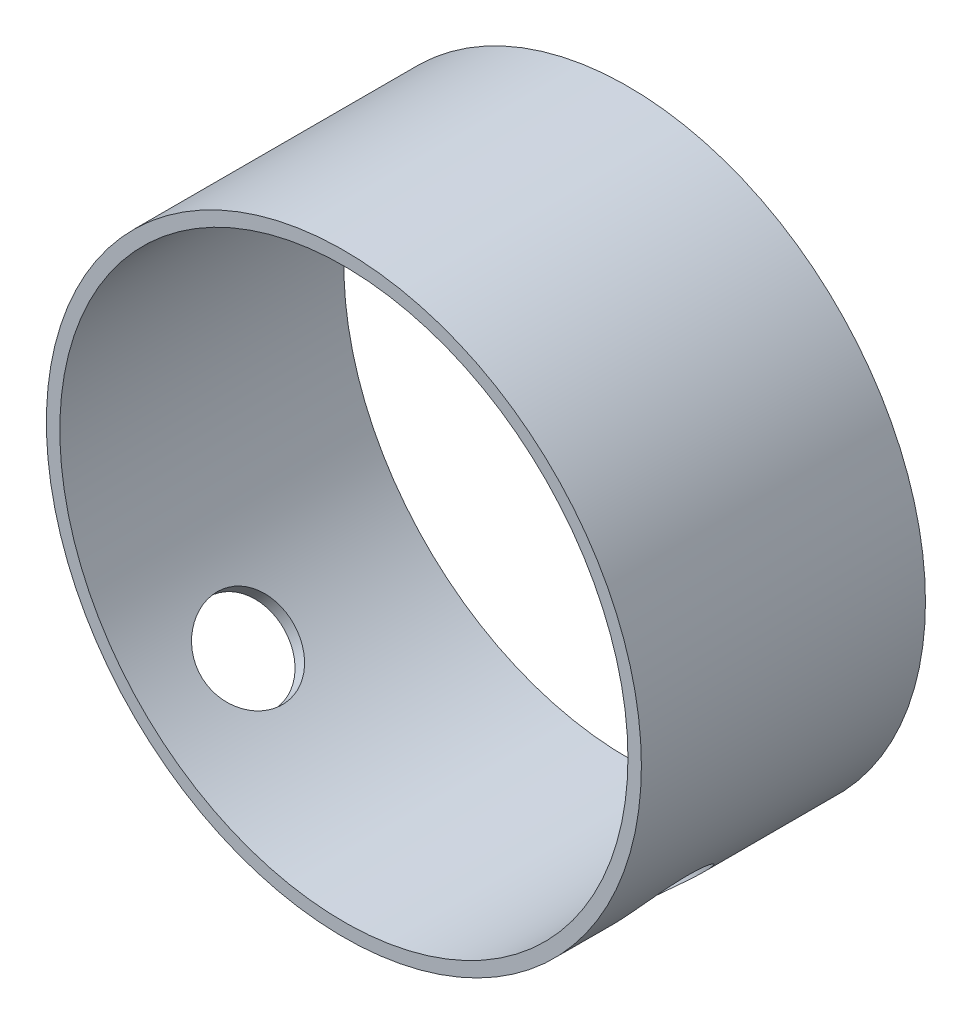
ISO-10303-21;
HEADER;
FILE_DESCRIPTION(('STEP AP214'),'2;1');
FILE_NAME('part.step','',(''),(''),'','','');
FILE_SCHEMA(('AUTOMOTIVE_DESIGN { 1 0 10303 214 1 1 1 1 }'));
ENDSEC;
DATA;
#1=APPLICATION_CONTEXT('core data for automotive mechanical design processes');
#2=APPLICATION_PROTOCOL_DEFINITION('international standard','automotive_design',2000,#1);
#3=PRODUCT_CONTEXT('',#1,'mechanical');
#4=PRODUCT('Part','Part','',(#3));
#5=PRODUCT_RELATED_PRODUCT_CATEGORY('part','',(#4));
#6=PRODUCT_DEFINITION_FORMATION('','',#4);
#7=PRODUCT_DEFINITION_CONTEXT('part definition',#1,'design');
#8=PRODUCT_DEFINITION('design','',#6,#7);
#9=PRODUCT_DEFINITION_SHAPE('','',#8);
#10=(LENGTH_UNIT() NAMED_UNIT(*) SI_UNIT(.MILLI.,.METRE.));
#11=(NAMED_UNIT(*) PLANE_ANGLE_UNIT() SI_UNIT($,.RADIAN.));
#12=(NAMED_UNIT(*) SI_UNIT($,.STERADIAN.) SOLID_ANGLE_UNIT());
#13=UNCERTAINTY_MEASURE_WITH_UNIT(LENGTH_MEASURE(1.E-05),#10,'distance_accuracy_value','');
#14=(GEOMETRIC_REPRESENTATION_CONTEXT(3) GLOBAL_UNCERTAINTY_ASSIGNED_CONTEXT((#13)) GLOBAL_UNIT_ASSIGNED_CONTEXT((#10,
#11,#12)) REPRESENTATION_CONTEXT('',''));
#15=CARTESIAN_POINT('',(0.,0.,0.));
#16=DIRECTION('',(0.,0.,1.));
#17=DIRECTION('',(1.,0.,0.));
#18=AXIS2_PLACEMENT_3D('',#15,#16,#17);
#19=CARTESIAN_POINT('',(0.,0.,19.05));
#20=DIRECTION('',(0.,0.,-1.));
#21=DIRECTION('',(-1.,0.,0.));
#22=AXIS2_PLACEMENT_3D('',#19,#20,#21);
#23=CYLINDRICAL_SURFACE('',#22,39.9034);
#24=CARTESIAN_POINT('',(23.501589202211,-32.2483586641323,5.08));
#25=CARTESIAN_POINT('',(23.5015867388899,-32.2483596567313,5.25264083242992));
#26=CARTESIAN_POINT('',(23.5075056643356,-32.2440492099816,5.42524780021009));
#27=CARTESIAN_POINT('',(23.5311150998789,-32.2268239254793,5.76927656795172));
#28=CARTESIAN_POINT('',(23.5488080465942,-32.2139073066904,5.94069811517103));
#29=CARTESIAN_POINT('',(23.5957998250419,-32.1795028752748,6.28118488099849));
#30=CARTESIAN_POINT('',(23.6251064033576,-32.1580093415639,6.45024844869669));
#31=CARTESIAN_POINT('',(23.6950313731235,-32.1065212103511,6.78476842586552));
#32=CARTESIAN_POINT('',(23.7356539152229,-32.076523493478,6.95022348769339));
#33=CARTESIAN_POINT('',(23.8277355392797,-32.0081806866277,7.27610556281692));
#34=CARTESIAN_POINT('',(23.8791819337938,-31.9698453680143,7.43653821251666));
#35=CARTESIAN_POINT('',(23.9924446547623,-31.8849327931174,7.7515215472872));
#36=CARTESIAN_POINT('',(24.0542648023972,-31.8383524994427,7.90607003909233));
#37=CARTESIAN_POINT('',(24.1876222577679,-31.7371589742097,8.20808256396437));
#38=CARTESIAN_POINT('',(24.2591545882514,-31.6825498560443,8.35555017374673));
#39=CARTESIAN_POINT('',(24.4113067022659,-31.5654661129088,8.64253448812991));
#40=CARTESIAN_POINT('',(24.4919298598801,-31.5029885665392,8.78204821150893));
#41=CARTESIAN_POINT('',(24.6621102215491,-31.3699441665952,9.05310297986707));
#42=CARTESIAN_POINT('',(24.7517281497411,-31.2993217736931,9.18457864494051));
#43=CARTESIAN_POINT('',(24.9386127042829,-31.1506209969095,9.43758606094543));
#44=CARTESIAN_POINT('',(25.0358821493897,-31.072539862996,9.55911411329576));
#45=CARTESIAN_POINT('',(25.2371358015658,-30.9093041917313,9.79129652382624));
#46=CARTESIAN_POINT('',(25.3411179126482,-30.8241518599611,9.90195424924258));
#47=CARTESIAN_POINT('',(25.5549494829816,-30.6471068704479,10.1117057895883));
#48=CARTESIAN_POINT('',(25.6648010915063,-30.5552117389863,10.2107953256242));
#49=CARTESIAN_POINT('',(25.8899284242549,-30.3646962650921,10.3971072700783));
#50=CARTESIAN_POINT('',(26.0052275891763,-30.266045844583,10.4842706211443));
#51=CARTESIAN_POINT('',(26.2398141953946,-30.0628936055371,10.6455630747084));
#52=CARTESIAN_POINT('',(26.3591031049072,-29.9583896231436,10.7196873146172));
#53=CARTESIAN_POINT('',(26.6005877649385,-29.7441770659692,10.8542850395984));
#54=CARTESIAN_POINT('',(26.7227822904992,-29.6344706657028,10.9147641682632));
#55=CARTESIAN_POINT('',(26.9691204180119,-29.4104690823445,11.0216720204418));
#56=CARTESIAN_POINT('',(27.0932647157193,-29.2961722374552,11.0680956027885));
#57=CARTESIAN_POINT('',(27.4650260998787,-28.9493912247405,11.1850089226742));
#58=CARTESIAN_POINT('',(27.7141992872647,-28.7110476182863,11.2343760436793));
#59=CARTESIAN_POINT('',(28.2084410009719,-28.2256156963798,11.2746251576714));
#60=CARTESIAN_POINT('',(28.4535097693208,-27.9785278992452,11.2655106114424));
#61=CARTESIAN_POINT('',(28.9306573414012,-27.4848176601488,11.1894958646732));
#62=CARTESIAN_POINT('',(29.1628294716007,-27.2382093780848,11.1230915666442));
#63=CARTESIAN_POINT('',(29.6104513458667,-26.7509264569231,10.9351406732932));
#64=CARTESIAN_POINT('',(29.8259006359154,-26.5102519790466,10.8135925814543));
#65=CARTESIAN_POINT('',(30.2359965850196,-26.0415684535962,10.5183064172627));
#66=CARTESIAN_POINT('',(30.430556268792,-25.8136141242541,10.3443608078229));
#67=CARTESIAN_POINT('',(30.793959619304,-25.379002341072,9.94936748084762));
#68=CARTESIAN_POINT('',(30.9628014791169,-25.1723463839789,9.72831645631493));
#69=CARTESIAN_POINT('',(31.2733821460273,-24.7854636501134,9.24262763989351));
#70=CARTESIAN_POINT('',(31.4148178052695,-24.6055371143484,8.97755662010405));
#71=CARTESIAN_POINT('',(31.6660285862854,-24.281395136065,8.41282045975597));
#72=CARTESIAN_POINT('',(31.7758034871949,-24.1371799426687,8.11315507788872));
#73=CARTESIAN_POINT('',(31.962083771596,-23.8899691946169,7.48727743703968));
#74=CARTESIAN_POINT('',(32.0385600869982,-23.7870096604244,7.1610422775753));
#75=CARTESIAN_POINT('',(32.1569443235447,-23.6267282215711,6.49153673138903));
#76=CARTESIAN_POINT('',(32.1988548549292,-23.5694028708498,6.14826763306334));
#77=CARTESIAN_POINT('',(32.2472344991652,-23.5031676226052,5.45824063303899));
#78=CARTESIAN_POINT('',(32.2540657066028,-23.4937630863569,5.11155554044715));
#79=CARTESIAN_POINT('',(32.2331638926317,-23.5224314124339,4.42121380023893));
#80=CARTESIAN_POINT('',(32.2054320190917,-23.5605026980477,4.0775570524304));
#81=CARTESIAN_POINT('',(32.1160584125507,-23.6821813482704,3.40491767910432));
#82=CARTESIAN_POINT('',(32.0545999935968,-23.7655425243161,3.07586602926));
#83=CARTESIAN_POINT('',(31.898792598848,-23.9742616467967,2.43959661019747));
#84=CARTESIAN_POINT('',(31.8044418981428,-24.0996217956942,2.13237998705142));
#85=CARTESIAN_POINT('',(31.5833531649848,-24.3886526984383,1.54579133230891));
#86=CARTESIAN_POINT('',(31.4563614038813,-24.5526226999963,1.26666242869012));
#87=CARTESIAN_POINT('',(31.1723510291138,-24.9122103157281,0.746676206979608));
#88=CARTESIAN_POINT('',(31.0153305985458,-25.1078298447666,0.505821206290403));
#89=CARTESIAN_POINT('',(30.6724148441704,-25.5256313432228,0.0670331661247737));
#90=CARTESIAN_POINT('',(30.4862743496482,-25.7480347735486,-0.130497663992802));
#91=CARTESIAN_POINT('',(30.0897845883679,-26.2102793814115,-0.474222001162207));
#92=CARTESIAN_POINT('',(29.8794360201958,-26.4501200556787,-0.620416989148132));
#93=CARTESIAN_POINT('',(29.4401299630825,-26.9382159302453,-0.856687835609248));
#94=CARTESIAN_POINT('',(29.211248438385,-27.1864345693733,-0.946980850998428));
#95=CARTESIAN_POINT('',(28.7397428844998,-27.6843949395101,-1.06956437613328));
#96=CARTESIAN_POINT('',(28.4971198284347,-27.9341365615522,-1.10185898781945));
#97=CARTESIAN_POINT('',(28.129604500408,-28.3025919386892,-1.10610328845747));
#98=CARTESIAN_POINT('',(28.0070951071386,-28.4238206041768,-1.10028294242092));
#99=CARTESIAN_POINT('',(27.7613135812936,-28.6639181728784,-1.07428782999871));
#100=CARTESIAN_POINT('',(27.6380417515924,-28.7827879429446,-1.05411844094159));
#101=CARTESIAN_POINT('',(27.3916092571537,-29.0174096010688,-0.999561921835617));
#102=CARTESIAN_POINT('',(27.2684486480078,-29.1331603577625,-0.965169704740712));
#103=CARTESIAN_POINT('',(27.0232652523705,-29.360729306101,-0.882445024006713));
#104=CARTESIAN_POINT('',(26.9012420711332,-29.4725489024725,-0.834117597842497));
#105=CARTESIAN_POINT('',(26.6593107747604,-29.6915661089358,-0.723902609240605));
#106=CARTESIAN_POINT('',(26.5394016629286,-29.7987659334664,-0.662021632057408));
#107=CARTESIAN_POINT('',(26.302641509204,-30.0079544216608,-0.525162508171096));
#108=CARTESIAN_POINT('',(26.1857893841401,-30.1099449436597,-0.45018907476797));
#109=CARTESIAN_POINT('',(25.9560078762769,-30.3082502027024,-0.287635068674875));
#110=CARTESIAN_POINT('',(25.8430800169274,-30.4045627453688,-0.200049666254614));
#111=CARTESIAN_POINT('',(25.6221720104697,-30.5909547948338,-0.012942750161353));
#112=CARTESIAN_POINT('',(25.5141901291512,-30.6810364920957,0.0865745348629405));
#113=CARTESIAN_POINT('',(25.3029568605494,-30.8554803099064,0.297970969642424));
#114=CARTESIAN_POINT('',(25.1997659294397,-30.9397736611605,0.409967298047581));
#115=CARTESIAN_POINT('',(25.0002678213334,-31.1011961705694,0.64464592230986));
#116=CARTESIAN_POINT('',(24.903958187665,-31.1783278884533,0.767324369520395));
#117=CARTESIAN_POINT('',(24.7189920782562,-31.325177078556,1.02263337571436));
#118=CARTESIAN_POINT('',(24.6303402341005,-31.3948900696108,1.15526986813435));
#119=CARTESIAN_POINT('',(24.4616037479121,-31.5265400024045,1.42946714718439));
#120=CARTESIAN_POINT('',(24.3815159566361,-31.5884798040284,1.57102462267235));
#121=CARTESIAN_POINT('',(24.230142475845,-31.7047425117433,1.86307066236796));
#122=CARTESIAN_POINT('',(24.1589165958555,-31.7590139651979,2.01361072902575));
#123=CARTESIAN_POINT('',(24.0265966732744,-31.8592352816353,2.32167621673551));
#124=CARTESIAN_POINT('',(23.9654989059264,-31.9051882044498,2.47919904264645));
#125=CARTESIAN_POINT('',(23.8540594658356,-31.9885921138453,2.80005854757225));
#126=CARTESIAN_POINT('',(23.8037100183054,-32.0260492470817,2.96339092379892));
#127=CARTESIAN_POINT('',(23.7142424315332,-32.0923531130944,3.29475266892636));
#128=CARTESIAN_POINT('',(23.6751218043471,-32.1212017532909,3.46278098828972));
#129=CARTESIAN_POINT('',(23.5954091342363,-32.1798288134672,3.86920112208735));
#130=CARTESIAN_POINT('',(23.5602835755989,-32.2055150555432,4.10928848478571));
#131=CARTESIAN_POINT('',(23.5133755143432,-32.2397791580513,4.5929397205141));
#132=CARTESIAN_POINT('',(23.5015926765338,-32.2483572641487,4.83650354357311));
#133=CARTESIAN_POINT('',(23.501589202211,-32.2483586641323,5.08));
#134=B_SPLINE_CURVE_WITH_KNOTS('',3,(#24,#25,#26,#27,#28,#29,#30,#31,#32,#33,#34,#35,#36,#37,
#38,#39,#40,#41,#42,#43,#44,#45,#46,#47,#48,#49,#50,#51,#52,#53,#54,#55,#56,#57,#58,#59,#60,#61,
#62,#63,#64,#65,#66,#67,#68,#69,#70,#71,#72,#73,#74,#75,#76,#77,#78,#79,#80,#81,#82,#83,#84,#85,
#86,#87,#88,#89,#90,#91,#92,#93,#94,#95,#96,#97,#98,#99,#100,#101,#102,#103,#104,#105,#106,#107,
#108,#109,#110,#111,#112,#113,#114,#115,#116,#117,#118,#119,#120,#121,#122,#123,#124,#125,#126,
#127,#128,#129,#130,#131,#132,#133),.UNSPECIFIED.,.T.,.F.,(4,2,2,2,2,2,2,2,2,2,2,2,2,2,2,2,2,2,
2,2,2,2,2,2,2,2,2,2,2,2,2,2,2,2,2,2,2,2,2,2,2,2,2,2,2,2,2,2,2,2,2,2,2,2,4),(0.,
0.517709092500926,1.03552535752683,1.55368760193161,2.07204015695425,2.58978846420537,
3.10772790480225,3.62540290918593,4.14327068634191,4.66490568335334,5.18673375460928,
5.70839966918645,6.2302579326,6.75461346576402,7.27916413071403,7.80349744314928,
8.32802231252932,9.36753841383145,10.4069929999991,11.4375392803052,12.4681135297113,
13.5028246029995,14.5376083412806,15.583255653984,16.6289102609098,17.6754758536253,
18.7219624075493,19.7576249245075,20.7932530471644,21.8233071799754,22.8534153381786,
23.8917866629276,24.9302208348914,25.9779218311203,27.025592600834,28.0691676227002,
29.1126688347547,29.6295137255133,30.1461650297188,30.6630012834423,31.1796509384106,
31.6960501238297,32.2122637867332,32.7286756610432,33.2449050574206,33.7664721113912,
34.2878520220964,34.8095450975504,35.3310456672412,35.8558942229437,36.3805493278896,
36.9048236283615,37.4289816767514,38.1591805405967,38.8893689190334),.UNSPECIFIED.);
#135=CARTESIAN_POINT('',(23.501589202211,-32.2483586641323,5.08));
#136=VERTEX_POINT('',#135);
#137=EDGE_CURVE('E72',#136,#136,#134,.T.);
#138=ORIENTED_EDGE('',*,*,#137,.T.);
#139=EDGE_LOOP('',(#138));
#140=FACE_BOUND('',#139,.T.);
#141=CARTESIAN_POINT('',(0.,0.,19.05));
#142=DIRECTION('',(0.,0.,1.));
#143=DIRECTION('',(1.,0.,0.));
#144=AXIS2_PLACEMENT_3D('',#141,#142,#143);
#145=CIRCLE('',#144,39.9034);
#146=CARTESIAN_POINT('',(39.9034,0.,19.05));
#147=VERTEX_POINT('',#146);
#148=EDGE_CURVE('E10',#147,#147,#145,.T.);
#149=ORIENTED_EDGE('',*,*,#148,.F.);
#150=EDGE_LOOP('',(#149));
#151=FACE_BOUND('',#150,.T.);
#152=CARTESIAN_POINT('',(0.,0.,-19.05));
#153=DIRECTION('',(0.,0.,1.));
#154=DIRECTION('',(1.,0.,0.));
#155=AXIS2_PLACEMENT_3D('',#152,#153,#154);
#156=CIRCLE('',#155,39.9034);
#157=CARTESIAN_POINT('',(39.9034,0.,-19.05));
#158=VERTEX_POINT('',#157);
#159=EDGE_CURVE('E56',#158,#158,#156,.T.);
#160=ORIENTED_EDGE('',*,*,#159,.T.);
#161=EDGE_LOOP('',(#160));
#162=FACE_BOUND('',#161,.T.);
#163=CARTESIAN_POINT('',(-32.2483586641323,-23.501589202211,5.08));
#164=CARTESIAN_POINT('',(-32.2483596567313,-23.5015867388899,4.90735916757008));
#165=CARTESIAN_POINT('',(-32.2440492099816,-23.5075056643356,4.73475219978991));
#166=CARTESIAN_POINT('',(-32.2268239254793,-23.5311150998789,4.39072343204828));
#167=CARTESIAN_POINT('',(-32.2139073066904,-23.5488080465942,4.21930188482897));
#168=CARTESIAN_POINT('',(-32.1795028752748,-23.5957998250419,3.87881511900151));
#169=CARTESIAN_POINT('',(-32.1580093415639,-23.6251064033576,3.70975155130331));
#170=CARTESIAN_POINT('',(-32.1065212103511,-23.6950313731235,3.37523157413448));
#171=CARTESIAN_POINT('',(-32.076523493478,-23.7356539152229,3.20977651230661));
#172=CARTESIAN_POINT('',(-32.0081806866277,-23.8277355392797,2.88389443718308));
#173=CARTESIAN_POINT('',(-31.9698453680143,-23.8791819337938,2.72346178748334));
#174=CARTESIAN_POINT('',(-31.8849327931174,-23.9924446547623,2.4084784527128));
#175=CARTESIAN_POINT('',(-31.8383524994427,-24.0542648023972,2.25392996090767));
#176=CARTESIAN_POINT('',(-31.7371589742097,-24.1876222577679,1.95191743603563));
#177=CARTESIAN_POINT('',(-31.6825498560443,-24.2591545882514,1.80444982625327));
#178=CARTESIAN_POINT('',(-31.5654661129088,-24.4113067022659,1.51746551187009));
#179=CARTESIAN_POINT('',(-31.5029885665392,-24.4919298598801,1.37795178849106));
#180=CARTESIAN_POINT('',(-31.3699441665952,-24.6621102215491,1.10689702013293));
#181=CARTESIAN_POINT('',(-31.2993217736931,-24.7517281497411,0.975421355059488));
#182=CARTESIAN_POINT('',(-31.1506209969095,-24.938612704283,0.722413939054562));
#183=CARTESIAN_POINT('',(-31.072539862996,-25.0358821493897,0.600885886704235));
#184=CARTESIAN_POINT('',(-30.9093041917313,-25.2371358015658,0.368703476173754));
#185=CARTESIAN_POINT('',(-30.8241518599611,-25.3411179126482,0.258045750757416));
#186=CARTESIAN_POINT('',(-30.6471068704479,-25.5549494829816,0.0482942104116645));
#187=CARTESIAN_POINT('',(-30.5552117389863,-25.6648010915063,-0.0507953256242378));
#188=CARTESIAN_POINT('',(-30.3646962650921,-25.8899284242549,-0.237107270078324));
#189=CARTESIAN_POINT('',(-30.266045844583,-26.0052275891763,-0.324270621144321));
#190=CARTESIAN_POINT('',(-30.062893605537,-26.2398141953946,-0.485563074708415));
#191=CARTESIAN_POINT('',(-29.9583896231436,-26.3591031049072,-0.559687314617174));
#192=CARTESIAN_POINT('',(-29.7441770659692,-26.6005877649385,-0.694285039598395));
#193=CARTESIAN_POINT('',(-29.6344706657028,-26.7227822904992,-0.754764168263189));
#194=CARTESIAN_POINT('',(-29.4104690823445,-26.9691204180119,-0.861672020441759));
#195=CARTESIAN_POINT('',(-29.2961722374552,-27.0932647157193,-0.908095602788476));
#196=CARTESIAN_POINT('',(-28.9493912247405,-27.4650260998787,-1.02500892267419));
#197=CARTESIAN_POINT('',(-28.7110476182863,-27.7141992872647,-1.07437604367928));
#198=CARTESIAN_POINT('',(-28.2256156963798,-28.2084410009719,-1.11462515767135));
#199=CARTESIAN_POINT('',(-27.9785278992452,-28.4535097693208,-1.10551061144245));
#200=CARTESIAN_POINT('',(-27.4848176601488,-28.9306573414012,-1.02949586467322));
#201=CARTESIAN_POINT('',(-27.2382093780848,-29.1628294716007,-0.963091566644184));
#202=CARTESIAN_POINT('',(-26.7509264569231,-29.6104513458667,-0.775140673293199));
#203=CARTESIAN_POINT('',(-26.5102519790466,-29.8259006359154,-0.653592581454253));
#204=CARTESIAN_POINT('',(-26.0415684535962,-30.2359965850196,-0.358306417262673));
#205=CARTESIAN_POINT('',(-25.8136141242541,-30.430556268792,-0.184360807822856));
#206=CARTESIAN_POINT('',(-25.379002341072,-30.793959619304,0.210632519152378));
#207=CARTESIAN_POINT('',(-25.1723463839789,-30.9628014791169,0.431683543685068));
#208=CARTESIAN_POINT('',(-24.7854636501134,-31.2733821460273,0.917372360106488));
#209=CARTESIAN_POINT('',(-24.6055371143484,-31.4148178052695,1.18244337989595));
#210=CARTESIAN_POINT('',(-24.281395136065,-31.6660285862854,1.74717954024403));
#211=CARTESIAN_POINT('',(-24.1371799426687,-31.7758034871949,2.04684492211128));
#212=CARTESIAN_POINT('',(-23.8899691946169,-31.962083771596,2.67272256296032));
#213=CARTESIAN_POINT('',(-23.7870096604244,-32.0385600869982,2.9989577224247));
#214=CARTESIAN_POINT('',(-23.6267282215711,-32.1569443235447,3.66846326861097));
#215=CARTESIAN_POINT('',(-23.5694028708498,-32.1988548549292,4.01173236693666));
#216=CARTESIAN_POINT('',(-23.5031676226052,-32.2472344991652,4.70175936696101));
#217=CARTESIAN_POINT('',(-23.4937630863569,-32.2540657066029,5.04844445955285));
#218=CARTESIAN_POINT('',(-23.5224314124339,-32.2331638926317,5.73878619976107));
#219=CARTESIAN_POINT('',(-23.5605026980477,-32.2054320190917,6.0824429475696));
#220=CARTESIAN_POINT('',(-23.6821813482704,-32.1160584125507,6.75508232089568));
#221=CARTESIAN_POINT('',(-23.7655425243161,-32.0545999935968,7.08413397074));
#222=CARTESIAN_POINT('',(-23.9742616467967,-31.898792598848,7.72040338980253));
#223=CARTESIAN_POINT('',(-24.0996217956942,-31.8044418981428,8.02762001294858));
#224=CARTESIAN_POINT('',(-24.3886526984383,-31.5833531649848,8.61420866769109));
#225=CARTESIAN_POINT('',(-24.5526226999963,-31.4563614038813,8.89333757130989));
#226=CARTESIAN_POINT('',(-24.9122103157281,-31.1723510291138,9.4133237930204));
#227=CARTESIAN_POINT('',(-25.1078298447666,-31.0153305985458,9.6541787937096));
#228=CARTESIAN_POINT('',(-25.5256313432228,-30.6724148441704,10.0929668338752));
#229=CARTESIAN_POINT('',(-25.7480347735486,-30.4862743496482,10.2904976639928));
#230=CARTESIAN_POINT('',(-26.2102793814115,-30.0897845883679,10.6342220011622));
#231=CARTESIAN_POINT('',(-26.4501200556787,-29.8794360201957,10.7804169891481));
#232=CARTESIAN_POINT('',(-26.9382159302453,-29.4401299630825,11.0166878356092));
#233=CARTESIAN_POINT('',(-27.1864345693733,-29.211248438385,11.1069808509984));
#234=CARTESIAN_POINT('',(-27.6843949395101,-28.7397428844998,11.2295643761333));
#235=CARTESIAN_POINT('',(-27.9341365615522,-28.4971198284347,11.2618589878195));
#236=CARTESIAN_POINT('',(-28.3025919386892,-28.129604500408,11.2661032884575));
#237=CARTESIAN_POINT('',(-28.4238206041768,-28.0070951071386,11.2602829424209));
#238=CARTESIAN_POINT('',(-28.6639181728784,-27.7613135812936,11.2342878299987));
#239=CARTESIAN_POINT('',(-28.7827879429446,-27.6380417515924,11.2141184409416));
#240=CARTESIAN_POINT('',(-29.0174096010688,-27.3916092571537,11.1595619218356));
#241=CARTESIAN_POINT('',(-29.1331603577625,-27.2684486480078,11.1251697047407));
#242=CARTESIAN_POINT('',(-29.360729306101,-27.0232652523705,11.0424450240067));
#243=CARTESIAN_POINT('',(-29.4725489024725,-26.9012420711332,10.9941175978425));
#244=CARTESIAN_POINT('',(-29.6915661089358,-26.6593107747604,10.8839026092406));
#245=CARTESIAN_POINT('',(-29.7987659334664,-26.5394016629286,10.8220216320574));
#246=CARTESIAN_POINT('',(-30.0079544216608,-26.302641509204,10.6851625081711));
#247=CARTESIAN_POINT('',(-30.1099449436597,-26.1857893841401,10.610189074768));
#248=CARTESIAN_POINT('',(-30.3082502027024,-25.9560078762769,10.4476350686749));
#249=CARTESIAN_POINT('',(-30.4045627453688,-25.8430800169274,10.3600496662546));
#250=CARTESIAN_POINT('',(-30.5909547948338,-25.6221720104697,10.1729427501614));
#251=CARTESIAN_POINT('',(-30.6810364920957,-25.5141901291512,10.0734254651371));
#252=CARTESIAN_POINT('',(-30.8554803099064,-25.3029568605494,9.86202903035757));
#253=CARTESIAN_POINT('',(-30.9397736611605,-25.1997659294397,9.75003270195242));
#254=CARTESIAN_POINT('',(-31.1011961705694,-25.0002678213334,9.51535407769014));
#255=CARTESIAN_POINT('',(-31.1783278884533,-24.903958187665,9.39267563047961));
#256=CARTESIAN_POINT('',(-31.325177078556,-24.7189920782562,9.13736662428565));
#257=CARTESIAN_POINT('',(-31.3948900696108,-24.6303402341005,9.00473013186565));
#258=CARTESIAN_POINT('',(-31.5265400024045,-24.4616037479121,8.73053285281561));
#259=CARTESIAN_POINT('',(-31.5884798040284,-24.3815159566361,8.58897537732765));
#260=CARTESIAN_POINT('',(-31.7047425117433,-24.230142475845,8.29692933763204));
#261=CARTESIAN_POINT('',(-31.7590139651979,-24.1589165958555,8.14638927097425));
#262=CARTESIAN_POINT('',(-31.8592352816353,-24.0265966732744,7.83832378326448));
#263=CARTESIAN_POINT('',(-31.9051882044498,-23.9654989059264,7.68080095735355));
#264=CARTESIAN_POINT('',(-31.9885921138453,-23.8540594658356,7.35994145242775));
#265=CARTESIAN_POINT('',(-32.0260492470817,-23.8037100183054,7.19660907620108));
#266=CARTESIAN_POINT('',(-32.0923531130944,-23.7142424315332,6.86524733107364));
#267=CARTESIAN_POINT('',(-32.1212017532909,-23.6751218043471,6.69721901171028));
#268=CARTESIAN_POINT('',(-32.1798288134672,-23.5954091342363,6.29079887791264));
#269=CARTESIAN_POINT('',(-32.2055150555433,-23.5602835755989,6.05071151521428));
#270=CARTESIAN_POINT('',(-32.2397791580513,-23.5133755143432,5.5670602794859));
#271=CARTESIAN_POINT('',(-32.2483572641487,-23.5015926765338,5.32349645642689));
#272=CARTESIAN_POINT('',(-32.2483586641323,-23.501589202211,5.08));
#273=B_SPLINE_CURVE_WITH_KNOTS('',3,(#163,#164,#165,#166,#167,#168,#169,#170,#171,#172,#173,
#174,#175,#176,#177,#178,#179,#180,#181,#182,#183,#184,#185,#186,#187,#188,#189,#190,#191,#192,
#193,#194,#195,#196,#197,#198,#199,#200,#201,#202,#203,#204,#205,#206,#207,#208,#209,#210,#211,
#212,#213,#214,#215,#216,#217,#218,#219,#220,#221,#222,#223,#224,#225,#226,#227,#228,#229,#230,
#231,#232,#233,#234,#235,#236,#237,#238,#239,#240,#241,#242,#243,#244,#245,#246,#247,#248,#249,
#250,#251,#252,#253,#254,#255,#256,#257,#258,#259,#260,#261,#262,#263,#264,#265,#266,#267,#268,
#269,#270,#271,#272),.UNSPECIFIED.,.T.,.F.,(4,2,2,2,2,2,2,2,2,2,2,2,2,2,2,2,2,2,2,2,2,2,2,2,2,2,
2,2,2,2,2,2,2,2,2,2,2,2,2,2,2,2,2,2,2,2,2,2,2,2,2,2,2,2,4),(0.,0.517709092500926,
1.03552535752683,1.55368760193161,2.07204015695425,2.58978846420537,3.10772790480225,
3.62540290918594,4.14327068634192,4.66490568335334,5.18673375460928,5.70839966918645,
6.2302579326,6.75461346576403,7.27916413071403,7.80349744314928,8.32802231252932,
9.36753841383145,10.4069929999991,11.4375392803052,12.4681135297113,13.5028246029994,
14.5376083412806,15.583255653984,16.6289102609098,17.6754758536253,18.7219624075493,
19.7576249245075,20.7932530471644,21.8233071799754,22.8534153381786,23.8917866629276,
24.9302208348914,25.9779218311203,27.025592600834,28.0691676227002,29.1126688347547,
29.6295137255133,30.1461650297188,30.6630012834423,31.1796509384106,31.6960501238297,
32.2122637867332,32.7286756610432,33.2449050574206,33.7664721113912,34.2878520220964,
34.8095450975504,35.3310456672412,35.8558942229437,36.3805493278896,36.9048236283615,
37.4289816767514,38.1591805405967,38.8893689190334),.UNSPECIFIED.);
#274=CARTESIAN_POINT('',(-32.2483586641323,-23.501589202211,5.08));
#275=VERTEX_POINT('',#274);
#276=EDGE_CURVE('E73',#275,#275,#273,.T.);
#277=ORIENTED_EDGE('',*,*,#276,.F.);
#278=EDGE_LOOP('',(#277));
#279=FACE_BOUND('',#278,.T.);
#280=ADVANCED_FACE('F43',(#140,#151,#162,#279),#23,.T.);
#281=CARTESIAN_POINT('',(0.,0.,19.05));
#282=DIRECTION('',(0.,0.,-1.));
#283=DIRECTION('',(-1.,0.,0.));
#284=AXIS2_PLACEMENT_3D('',#281,#282,#283);
#285=CYLINDRICAL_SURFACE('',#284,38.1);
#286=CARTESIAN_POINT('',(0.,0.,-19.05));
#287=DIRECTION('',(0.,0.,1.));
#288=DIRECTION('',(1.,0.,0.));
#289=AXIS2_PLACEMENT_3D('',#286,#287,#288);
#290=CIRCLE('',#289,38.1);
#291=CARTESIAN_POINT('',(38.1,0.,-19.05));
#292=VERTEX_POINT('',#291);
#293=EDGE_CURVE('E64',#292,#292,#290,.T.);
#294=ORIENTED_EDGE('',*,*,#293,.F.);
#295=EDGE_LOOP('',(#294));
#296=FACE_BOUND('',#295,.T.);
#297=CARTESIAN_POINT('',(0.,0.,19.05));
#298=DIRECTION('',(0.,0.,1.));
#299=DIRECTION('',(1.,0.,0.));
#300=AXIS2_PLACEMENT_3D('',#297,#298,#299);
#301=CIRCLE('',#300,38.1);
#302=CARTESIAN_POINT('',(38.1,0.,19.05));
#303=VERTEX_POINT('',#302);
#304=EDGE_CURVE('E61',#303,#303,#301,.T.);
#305=ORIENTED_EDGE('',*,*,#304,.T.);
#306=EDGE_LOOP('',(#305));
#307=FACE_BOUND('',#306,.T.);
#308=CARTESIAN_POINT('',(22.2100406689949,-30.9568101309161,5.08));
#309=CARTESIAN_POINT('',(22.2100380344628,-30.9568111423902,5.25253131267659));
#310=CARTESIAN_POINT('',(22.2159885565598,-30.9525451646509,5.42502744887078));
#311=CARTESIAN_POINT('',(22.2397224883509,-30.9354969396187,5.76883373814157));
#312=CARTESIAN_POINT('',(22.2575082823553,-30.9227129763087,5.94014364521496));
#313=CARTESIAN_POINT('',(22.3047426287871,-30.8886597129099,6.28040264208004));
#314=CARTESIAN_POINT('',(22.3341987153735,-30.8673849312157,6.44935013364298));
#315=CARTESIAN_POINT('',(22.4044731070853,-30.8164155642595,6.78363850453206));
#316=CARTESIAN_POINT('',(22.4452955831984,-30.7867178880741,6.94897803582441));
#317=CARTESIAN_POINT('',(22.5378174830761,-30.7190504501853,7.27462670156704));
#318=CARTESIAN_POINT('',(22.5895038296049,-30.6810906319885,7.43494162009639));
#319=CARTESIAN_POINT('',(22.7032785423474,-30.596995704062,7.74969574311966));
#320=CARTESIAN_POINT('',(22.7653707421026,-30.5508575810622,7.90413275635444));
#321=CARTESIAN_POINT('',(22.8992950056808,-30.4506038945882,8.20593450779907));
#322=CARTESIAN_POINT('',(22.9711221787216,-30.3964923357295,8.35330274729689));
#323=CARTESIAN_POINT('',(23.123876623798,-30.2804479743785,8.64010364915354));
#324=CARTESIAN_POINT('',(23.2048072773598,-30.2185122645141,8.77953333354473));
#325=CARTESIAN_POINT('',(23.3756705326952,-30.0865380021241,9.0505389852144));
#326=CARTESIAN_POINT('',(23.465670034992,-30.0164385312235,9.18204311484244));
#327=CARTESIAN_POINT('',(23.653322574719,-29.8687894924439,9.43511768072373));
#328=CARTESIAN_POINT('',(23.7509784332241,-29.7912371760774,9.5566844214083));
#329=CARTESIAN_POINT('',(23.9529995177707,-29.6290496603967,9.78895682420441));
#330=CARTESIAN_POINT('',(24.0573626635352,-29.5444166547365,9.89966582720997));
#331=CARTESIAN_POINT('',(24.2719413450095,-29.3683864872889,10.1095333833987));
#332=CARTESIAN_POINT('',(24.3821590242126,-29.2769868431731,10.2086876630741));
#333=CARTESIAN_POINT('',(24.6080540933475,-29.0873774489982,10.3951908185697));
#334=CARTESIAN_POINT('',(24.7237573262047,-28.9891341694272,10.4824743330961));
#335=CARTESIAN_POINT('',(24.9591224699973,-28.7867384346623,10.644005765548));
#336=CARTESIAN_POINT('',(25.0787858392084,-28.6825837923503,10.7182488165406));
#337=CARTESIAN_POINT('',(25.3209789797472,-28.4690015421987,10.853079411269));
#338=CARTESIAN_POINT('',(25.4435075300949,-28.3595761601186,10.9136726588134));
#339=CARTESIAN_POINT('',(25.6904644287714,-28.1360600588015,11.0208010135536));
#340=CARTESIAN_POINT('',(25.814893454097,-28.0219676515622,11.0673309822783));
#341=CARTESIAN_POINT('',(26.1872269779642,-27.6758495679049,11.1844851126581));
#342=CARTESIAN_POINT('',(26.4365996524781,-27.4378553689348,11.2340140552649));
#343=CARTESIAN_POINT('',(26.9309657963607,-26.9527960156274,11.2746133827293));
#344=CARTESIAN_POINT('',(27.1759595477499,-26.7057314486112,11.2656875460141));
#345=CARTESIAN_POINT('',(27.6524779643771,-26.2119636179344,11.1901042333507));
#346=CARTESIAN_POINT('',(27.8841075730675,-25.9652787798,11.1239901038975));
#347=CARTESIAN_POINT('',(28.3304301081062,-25.4775608901881,10.9367410117657));
#348=CARTESIAN_POINT('',(28.5451225393705,-25.2365280040652,10.8156044414464));
#349=CARTESIAN_POINT('',(28.9536377451899,-24.7667975693873,10.521210109785));
#350=CARTESIAN_POINT('',(29.1473653097753,-24.5381584718496,10.3477270950963));
#351=CARTESIAN_POINT('',(29.5090561700192,-24.1019918079591,9.95372781372125));
#352=CARTESIAN_POINT('',(29.6770174833731,-23.8944658663424,9.73320793141015));
#353=CARTESIAN_POINT('',(29.9860495237331,-23.505517744173,9.24837697529151));
#354=CARTESIAN_POINT('',(30.1267884297057,-23.324423570058,8.98359100528739));
#355=CARTESIAN_POINT('',(30.3767194796813,-22.9979849461999,8.41934776575779));
#356=CARTESIAN_POINT('',(30.4859113608681,-22.8526407942893,8.11989020741482));
#357=CARTESIAN_POINT('',(30.6712411835217,-22.6033015338215,7.49427801618383));
#358=CARTESIAN_POINT('',(30.7473452305247,-22.4993488349055,7.16809641222219));
#359=CARTESIAN_POINT('',(30.8652376573311,-22.3373507550412,6.49858604151601));
#360=CARTESIAN_POINT('',(30.9070288943685,-22.2793015517153,6.1552587050259));
#361=CARTESIAN_POINT('',(30.9554306447598,-22.2120020865018,5.46537092369733));
#362=CARTESIAN_POINT('',(30.9624346036959,-22.2022060893274,5.11889125096072));
#363=CARTESIAN_POINT('',(30.9422287142349,-22.2303569674959,4.4288928774254));
#364=CARTESIAN_POINT('',(30.9150201167163,-22.2683020973289,4.08537406883401));
#365=CARTESIAN_POINT('',(30.8270385733838,-22.3899355510393,3.41314412742256));
#366=CARTESIAN_POINT('',(30.7664667753298,-22.473349709832,3.08435689965232));
#367=CARTESIAN_POINT('',(30.6127337115953,-22.68231159331,2.44851221630309));
#368=CARTESIAN_POINT('',(30.5195705868254,-22.8078617215178,2.14145600151593));
#369=CARTESIAN_POINT('',(30.3009986700858,-23.0974577484036,1.5548281174616));
#370=CARTESIAN_POINT('',(30.1753142870686,-23.2618315535014,1.27552106343092));
#371=CARTESIAN_POINT('',(29.8939746003008,-23.622286574172,0.755051646751508));
#372=CARTESIAN_POINT('',(29.7383173006654,-23.8183699011303,0.513891826261197));
#373=CARTESIAN_POINT('',(29.3979129451625,-24.2372882125068,0.0741478684025671));
#374=CARTESIAN_POINT('',(29.2128948036286,-24.4603673717702,-0.123994130021275));
#375=CARTESIAN_POINT('',(28.8184071258188,-24.9239215916351,-0.46898384936268));
#376=CARTESIAN_POINT('',(28.6089383489409,-25.1643961118761,-0.615833162784825));
#377=CARTESIAN_POINT('',(28.1711199083638,-25.6535631752839,-0.85338183845785));
#378=CARTESIAN_POINT('',(27.9428535778544,-25.902216792877,-0.944315340343445));
#379=CARTESIAN_POINT('',(27.4722002627499,-26.4008596740654,-1.06818442284271));
#380=CARTESIAN_POINT('',(27.2298143794271,-26.6508488321157,-1.10112452048476));
#381=CARTESIAN_POINT('',(26.8624891711662,-27.0193755236808,-1.1063140089484));
#382=CARTESIAN_POINT('',(26.7400802500024,-27.1405174998289,-1.10081735057297));
#383=CARTESIAN_POINT('',(26.4944084245252,-27.3803887255727,-1.07549153919693));
#384=CARTESIAN_POINT('',(26.3711458578449,-27.4991188633366,-1.05566776431731));
#385=CARTESIAN_POINT('',(26.1246422829261,-27.7334098449391,-1.00182287775736));
#386=CARTESIAN_POINT('',(26.0014012980294,-27.848969544123,-0.967796708501773));
#387=CARTESIAN_POINT('',(25.755970400935,-28.076109578074,-0.885823040132713));
#388=CARTESIAN_POINT('',(25.6337801259309,-28.1876913320239,-0.8378805627921));
#389=CARTESIAN_POINT('',(25.3914530114361,-28.4061739122014,-0.728462442561683));
#390=CARTESIAN_POINT('',(25.2713148797452,-28.5130777556615,-0.666995681753966));
#391=CARTESIAN_POINT('',(25.0340184571044,-28.7216445540549,-0.530985489001084));
#392=CARTESIAN_POINT('',(24.9168591135669,-28.8233093736699,-0.456446751831467));
#393=CARTESIAN_POINT('',(24.6863898412581,-29.0209443873947,-0.29478012403067));
#394=CARTESIAN_POINT('',(24.5730814255696,-29.1169123539413,-0.207647354075084));
#395=CARTESIAN_POINT('',(24.3513458567553,-29.3026084853905,-0.0214599807770317));
#396=CARTESIAN_POINT('',(24.2429170002314,-29.3923388338265,0.077590417198077));
#397=CARTESIAN_POINT('',(24.0306275150123,-29.5661626937054,0.288135613693021));
#398=CARTESIAN_POINT('',(23.9268321209099,-29.6501813042388,0.399758049055127));
#399=CARTESIAN_POINT('',(23.726086126183,-29.81106138826,0.633704330384451));
#400=CARTESIAN_POINT('',(23.629133090129,-29.8879254114489,0.756024333653534));
#401=CARTESIAN_POINT('',(23.4428523748228,-30.034258998015,1.0106363074506));
#402=CARTESIAN_POINT('',(23.3535293045727,-30.1037240981235,1.14293421570872));
#403=CARTESIAN_POINT('',(23.1834356768961,-30.2349110398551,1.41648011677171));
#404=CARTESIAN_POINT('',(23.102661977063,-30.2966357280962,1.55772479037646));
#405=CARTESIAN_POINT('',(22.9498616998977,-30.412548614155,1.84926827988802));
#406=CARTESIAN_POINT('',(22.8779009420288,-30.4666804948383,1.99962400554402));
#407=CARTESIAN_POINT('',(22.7441377976636,-30.566667612862,2.30736618541716));
#408=CARTESIAN_POINT('',(22.6823316749636,-30.6125258949268,2.4647500265451));
#409=CARTESIAN_POINT('',(22.5695169512735,-30.6957948772238,2.78538203459086));
#410=CARTESIAN_POINT('',(22.5185007211676,-30.7332115474506,2.94862596189259));
#411=CARTESIAN_POINT('',(22.4277567326133,-30.7994947225091,3.27985907950141));
#412=CARTESIAN_POINT('',(22.3880265192361,-30.8283630868221,3.44784722909376));
#413=CARTESIAN_POINT('',(22.3064696285634,-30.8874561477862,3.85658526980015));
#414=CARTESIAN_POINT('',(22.270369565445,-30.9134518774327,4.09912507190867));
#415=CARTESIAN_POINT('',(22.2221571640659,-30.9481280035487,4.58780047280875));
#416=CARTESIAN_POINT('',(22.210044426362,-30.9568086883529,4.8339360116544));
#417=CARTESIAN_POINT('',(22.2100406689949,-30.9568101309161,5.08));
#418=B_SPLINE_CURVE_WITH_KNOTS('',3,(#308,#309,#310,#311,#312,#313,#314,#315,#316,#317,#318,
#319,#320,#321,#322,#323,#324,#325,#326,#327,#328,#329,#330,#331,#332,#333,#334,#335,#336,#337,
#338,#339,#340,#341,#342,#343,#344,#345,#346,#347,#348,#349,#350,#351,#352,#353,#354,#355,#356,
#357,#358,#359,#360,#361,#362,#363,#364,#365,#366,#367,#368,#369,#370,#371,#372,#373,#374,#375,
#376,#377,#378,#379,#380,#381,#382,#383,#384,#385,#386,#387,#388,#389,#390,#391,#392,#393,#394,
#395,#396,#397,#398,#399,#400,#401,#402,#403,#404,#405,#406,#407,#408,#409,#410,#411,#412,#413,
#414,#415,#416,#417),.UNSPECIFIED.,.T.,.F.,(4,2,2,2,2,2,2,2,2,2,2,2,2,2,2,2,2,2,2,2,2,2,2,2,2,2,
2,2,2,2,2,2,2,2,2,2,2,2,2,2,2,2,2,2,2,2,2,2,2,2,2,2,2,2,4),(0.,0.517378196488723,
1.03486065452367,1.55267773696729,2.07068508753818,2.58807242868695,3.10565079728823,
3.6229700954094,4.1404821925057,4.6621387177461,5.18398836506874,5.70567693366838,
6.22755784019654,6.75220501630335,7.27704758591276,7.80167043238333,8.32648473559095,
9.36577458314169,10.4049972532518,11.4344533769462,12.4639395811296,13.4979205488244,
14.5319810251149,15.5779455161228,16.6239187207373,17.6709608875946,18.7179158582133,
19.7530023247304,20.7880509475408,21.8169264732875,22.8458606981904,23.8838173987103,
24.9218432402794,25.9700798292678,27.0182838703406,28.0620682701568,29.1057713674104,
29.6221876883122,30.138410257187,30.6548168136984,31.1710372533626,31.6869196715289,
32.2026171895269,32.7185150431948,33.2342313832237,33.7557582872737,34.277098615921,
34.7987516736829,35.32021232189,35.8453565245845,36.3703070757084,36.8948852044727,
37.4193491397316,38.1572457021456,38.8951299768088),.UNSPECIFIED.);
#419=CARTESIAN_POINT('',(22.2100406689949,-30.9568101309161,5.08));
#420=VERTEX_POINT('',#419);
#421=EDGE_CURVE('E66',#420,#420,#418,.T.);
#422=ORIENTED_EDGE('',*,*,#421,.F.);
#423=EDGE_LOOP('',(#422));
#424=FACE_BOUND('',#423,.T.);
#425=CARTESIAN_POINT('',(-30.9568101309161,-22.2100406689949,5.08));
#426=CARTESIAN_POINT('',(-30.9568111423902,-22.2100380344628,4.90746868732341));
#427=CARTESIAN_POINT('',(-30.9525451646509,-22.2159885565598,4.73497255112922));
#428=CARTESIAN_POINT('',(-30.9354969396187,-22.2397224883509,4.39116626185843));
#429=CARTESIAN_POINT('',(-30.9227129763087,-22.2575082823553,4.21985635478504));
#430=CARTESIAN_POINT('',(-30.8886597129099,-22.3047426287871,3.87959735791996));
#431=CARTESIAN_POINT('',(-30.8673849312157,-22.3341987153735,3.71064986635702));
#432=CARTESIAN_POINT('',(-30.8164155642595,-22.4044731070853,3.37636149546794));
#433=CARTESIAN_POINT('',(-30.7867178880741,-22.4452955831984,3.21102196417559));
#434=CARTESIAN_POINT('',(-30.7190504501853,-22.5378174830761,2.88537329843296));
#435=CARTESIAN_POINT('',(-30.6810906319885,-22.5895038296049,2.72505837990361));
#436=CARTESIAN_POINT('',(-30.596995704062,-22.7032785423474,2.41030425688034));
#437=CARTESIAN_POINT('',(-30.5508575810622,-22.7653707421026,2.25586724364557));
#438=CARTESIAN_POINT('',(-30.4506038945882,-22.8992950056808,1.95406549220093));
#439=CARTESIAN_POINT('',(-30.3964923357295,-22.9711221787215,1.80669725270312));
#440=CARTESIAN_POINT('',(-30.2804479743785,-23.123876623798,1.51989635084646));
#441=CARTESIAN_POINT('',(-30.2185122645141,-23.2048072773598,1.38046666645527));
#442=CARTESIAN_POINT('',(-30.0865380021241,-23.3756705326952,1.1094610147856));
#443=CARTESIAN_POINT('',(-30.0164385312235,-23.465670034992,0.977956885157564));
#444=CARTESIAN_POINT('',(-29.8687894924439,-23.653322574719,0.724882319276275));
#445=CARTESIAN_POINT('',(-29.7912371760774,-23.7509784332241,0.603315578591701));
#446=CARTESIAN_POINT('',(-29.6290496603967,-23.9529995177707,0.371043175795598));
#447=CARTESIAN_POINT('',(-29.5444166547365,-24.0573626635352,0.260334172790039));
#448=CARTESIAN_POINT('',(-29.3683864872889,-24.2719413450095,0.0504666166012968));
#449=CARTESIAN_POINT('',(-29.2769868431731,-24.3821590242126,-0.0486876630740846));
#450=CARTESIAN_POINT('',(-29.0873774489982,-24.6080540933475,-0.235190818569654));
#451=CARTESIAN_POINT('',(-28.9891341694272,-24.7237573262047,-0.322474333096148));
#452=CARTESIAN_POINT('',(-28.7867384346623,-24.9591224699973,-0.48400576554799));
#453=CARTESIAN_POINT('',(-28.6825837923503,-25.0787858392084,-0.558248816540619));
#454=CARTESIAN_POINT('',(-28.4690015421987,-25.3209789797472,-0.693079411268995));
#455=CARTESIAN_POINT('',(-28.3595761601186,-25.4435075300949,-0.753672658813381));
#456=CARTESIAN_POINT('',(-28.1360600588015,-25.6904644287714,-0.860801013553602));
#457=CARTESIAN_POINT('',(-28.0219676515622,-25.814893454097,-0.907330982278282));
#458=CARTESIAN_POINT('',(-27.6758495679049,-26.1872269779642,-1.02448511265805));
#459=CARTESIAN_POINT('',(-27.4378553689348,-26.4365996524781,-1.07401405526493));
#460=CARTESIAN_POINT('',(-26.9527960156274,-26.9309657963607,-1.11461338272925));
#461=CARTESIAN_POINT('',(-26.7057314486112,-27.1759595477499,-1.10568754601408));
#462=CARTESIAN_POINT('',(-26.2119636179344,-27.6524779643771,-1.0301042333507));
#463=CARTESIAN_POINT('',(-25.9652787798,-27.8841075730675,-0.963990103897529));
#464=CARTESIAN_POINT('',(-25.4775608901881,-28.3304301081062,-0.776741011765699));
#465=CARTESIAN_POINT('',(-25.2365280040652,-28.5451225393705,-0.655604441446438));
#466=CARTESIAN_POINT('',(-24.7667975693873,-28.9536377451899,-0.361210109785028));
#467=CARTESIAN_POINT('',(-24.5381584718496,-29.1473653097753,-0.187727095096325));
#468=CARTESIAN_POINT('',(-24.1019918079591,-29.5090561700192,0.206272186278742));
#469=CARTESIAN_POINT('',(-23.8944658663424,-29.6770174833731,0.426792068589847));
#470=CARTESIAN_POINT('',(-23.505517744173,-29.9860495237331,0.911623024708484));
#471=CARTESIAN_POINT('',(-23.324423570058,-30.1267884297057,1.17640899471261));
#472=CARTESIAN_POINT('',(-22.9979849461999,-30.3767194796813,1.74065223424221));
#473=CARTESIAN_POINT('',(-22.8526407942893,-30.4859113608681,2.04010979258518));
#474=CARTESIAN_POINT('',(-22.6033015338215,-30.6712411835217,2.66572198381617));
#475=CARTESIAN_POINT('',(-22.4993488349055,-30.7473452305247,2.99190358777781));
#476=CARTESIAN_POINT('',(-22.3373507550412,-30.8652376573311,3.66141395848399));
#477=CARTESIAN_POINT('',(-22.2793015517153,-30.9070288943685,4.0047412949741));
#478=CARTESIAN_POINT('',(-22.2120020865018,-30.9554306447598,4.69462907630267));
#479=CARTESIAN_POINT('',(-22.2022060893274,-30.9624346036959,5.04110874903928));
#480=CARTESIAN_POINT('',(-22.2303569674959,-30.9422287142349,5.73110712257459));
#481=CARTESIAN_POINT('',(-22.2683020973289,-30.9150201167163,6.07462593116599));
#482=CARTESIAN_POINT('',(-22.3899355510393,-30.8270385733838,6.74685587257744));
#483=CARTESIAN_POINT('',(-22.473349709832,-30.7664667753298,7.07564310034768));
#484=CARTESIAN_POINT('',(-22.68231159331,-30.6127337115953,7.71148778369691));
#485=CARTESIAN_POINT('',(-22.8078617215178,-30.5195705868254,8.01854399848407));
#486=CARTESIAN_POINT('',(-23.0974577484036,-30.3009986700858,8.6051718825384));
#487=CARTESIAN_POINT('',(-23.2618315535013,-30.1753142870686,8.88447893656907));
#488=CARTESIAN_POINT('',(-23.622286574172,-29.8939746003008,9.40494835324849));
#489=CARTESIAN_POINT('',(-23.8183699011303,-29.7383173006654,9.6461081737388));
#490=CARTESIAN_POINT('',(-24.2372882125068,-29.3979129451625,10.0858521315974));
#491=CARTESIAN_POINT('',(-24.4603673717702,-29.2128948036286,10.2839941300213));
#492=CARTESIAN_POINT('',(-24.9239215916351,-28.8184071258188,10.6289838493627));
#493=CARTESIAN_POINT('',(-25.1643961118761,-28.6089383489409,10.7758331627848));
#494=CARTESIAN_POINT('',(-25.6535631752839,-28.1711199083638,11.0133818384579));
#495=CARTESIAN_POINT('',(-25.9022167928771,-27.9428535778544,11.1043153403434));
#496=CARTESIAN_POINT('',(-26.4008596740654,-27.4722002627499,11.2281844228427));
#497=CARTESIAN_POINT('',(-26.6508488321157,-27.2298143794271,11.2611245204848));
#498=CARTESIAN_POINT('',(-27.0193755236808,-26.8624891711662,11.2663140089484));
#499=CARTESIAN_POINT('',(-27.1405174998289,-26.7400802500025,11.260817350573));
#500=CARTESIAN_POINT('',(-27.3803887255727,-26.4944084245253,11.2354915391969));
#501=CARTESIAN_POINT('',(-27.4991188633366,-26.3711458578449,11.2156677643173));
#502=CARTESIAN_POINT('',(-27.7334098449391,-26.1246422829261,11.1618228777574));
#503=CARTESIAN_POINT('',(-27.848969544123,-26.0014012980294,11.1277967085018));
#504=CARTESIAN_POINT('',(-28.076109578074,-25.755970400935,11.0458230401327));
#505=CARTESIAN_POINT('',(-28.1876913320239,-25.6337801259309,10.9978805627921));
#506=CARTESIAN_POINT('',(-28.4061739122014,-25.3914530114361,10.8884624425617));
#507=CARTESIAN_POINT('',(-28.5130777556615,-25.2713148797452,10.826995681754));
#508=CARTESIAN_POINT('',(-28.7216445540549,-25.0340184571044,10.6909854890011));
#509=CARTESIAN_POINT('',(-28.8233093736699,-24.9168591135669,10.6164467518315));
#510=CARTESIAN_POINT('',(-29.0209443873947,-24.6863898412581,10.4547801240307));
#511=CARTESIAN_POINT('',(-29.1169123539413,-24.5730814255696,10.3676473540751));
#512=CARTESIAN_POINT('',(-29.3026084853906,-24.3513458567553,10.181459980777));
#513=CARTESIAN_POINT('',(-29.3923388338265,-24.2429170002314,10.0824095828019));
#514=CARTESIAN_POINT('',(-29.5661626937054,-24.0306275150123,9.87186438630698));
#515=CARTESIAN_POINT('',(-29.6501813042388,-23.9268321209099,9.76024195094488));
#516=CARTESIAN_POINT('',(-29.81106138826,-23.726086126183,9.52629566961556));
#517=CARTESIAN_POINT('',(-29.8879254114489,-23.629133090129,9.40397566634647));
#518=CARTESIAN_POINT('',(-30.034258998015,-23.4428523748228,9.14936369254941));
#519=CARTESIAN_POINT('',(-30.1037240981235,-23.3535293045727,9.01706578429128));
#520=CARTESIAN_POINT('',(-30.2349110398551,-23.1834356768961,8.74351988322829));
#521=CARTESIAN_POINT('',(-30.2966357280962,-23.102661977063,8.60227520962354));
#522=CARTESIAN_POINT('',(-30.412548614155,-22.9498616998977,8.31073172011198));
#523=CARTESIAN_POINT('',(-30.4666804948383,-22.8779009420288,8.16037599445598));
#524=CARTESIAN_POINT('',(-30.566667612862,-22.7441377976636,7.85263381458284));
#525=CARTESIAN_POINT('',(-30.6125258949268,-22.6823316749636,7.6952499734549));
#526=CARTESIAN_POINT('',(-30.6957948772238,-22.5695169512735,7.37461796540914));
#527=CARTESIAN_POINT('',(-30.7332115474506,-22.5185007211676,7.21137403810742));
#528=CARTESIAN_POINT('',(-30.7994947225091,-22.4277567326133,6.8801409204986));
#529=CARTESIAN_POINT('',(-30.8283630868221,-22.3880265192361,6.71215277090625));
#530=CARTESIAN_POINT('',(-30.8874561477862,-22.3064696285634,6.30341473019985));
#531=CARTESIAN_POINT('',(-30.9134518774327,-22.270369565445,6.06087492809134));
#532=CARTESIAN_POINT('',(-30.9481280035487,-22.2221571640659,5.57219952719126));
#533=CARTESIAN_POINT('',(-30.9568086883529,-22.210044426362,5.3260639883456));
#534=CARTESIAN_POINT('',(-30.9568101309161,-22.2100406689949,5.08));
#535=B_SPLINE_CURVE_WITH_KNOTS('',3,(#425,#426,#427,#428,#429,#430,#431,#432,#433,#434,#435,
#436,#437,#438,#439,#440,#441,#442,#443,#444,#445,#446,#447,#448,#449,#450,#451,#452,#453,#454,
#455,#456,#457,#458,#459,#460,#461,#462,#463,#464,#465,#466,#467,#468,#469,#470,#471,#472,#473,
#474,#475,#476,#477,#478,#479,#480,#481,#482,#483,#484,#485,#486,#487,#488,#489,#490,#491,#492,
#493,#494,#495,#496,#497,#498,#499,#500,#501,#502,#503,#504,#505,#506,#507,#508,#509,#510,#511,
#512,#513,#514,#515,#516,#517,#518,#519,#520,#521,#522,#523,#524,#525,#526,#527,#528,#529,#530,
#531,#532,#533,#534),.UNSPECIFIED.,.T.,.F.,(4,2,2,2,2,2,2,2,2,2,2,2,2,2,2,2,2,2,2,2,2,2,2,2,2,2,
2,2,2,2,2,2,2,2,2,2,2,2,2,2,2,2,2,2,2,2,2,2,2,2,2,2,2,2,4),(0.,0.517378196488723,
1.03486065452367,1.55267773696728,2.07068508753818,2.58807242868695,3.10565079728822,
3.62297009540939,4.1404821925057,4.6621387177461,5.18398836506873,5.70567693366837,
6.22755784019653,6.75220501630335,7.27704758591276,7.80167043238333,8.32648473559095,
9.36577458314169,10.4049972532518,11.4344533769462,12.4639395811296,13.4979205488244,
14.5319810251149,15.5779455161228,16.6239187207373,17.6709608875946,18.7179158582133,
19.7530023247304,20.7880509475408,21.8169264732875,22.8458606981904,23.8838173987103,
24.9218432402794,25.9700798292678,27.0182838703406,28.0620682701568,29.1057713674104,
29.6221876883122,30.1384102571869,30.6548168136984,31.1710372533626,31.6869196715289,
32.2026171895268,32.7185150431948,33.2342313832237,33.7557582872737,34.277098615921,
34.7987516736829,35.32021232189,35.8453565245845,36.3703070757084,36.8948852044727,
37.4193491397316,38.1572457021455,38.8951299768088),.UNSPECIFIED.);
#536=CARTESIAN_POINT('',(-30.9568101309161,-22.2100406689949,5.08));
#537=VERTEX_POINT('',#536);
#538=EDGE_CURVE('E47',#537,#537,#535,.T.);
#539=ORIENTED_EDGE('',*,*,#538,.T.);
#540=EDGE_LOOP('',(#539));
#541=FACE_BOUND('',#540,.T.);
#542=ADVANCED_FACE('F74',(#296,#307,#424,#541),#285,.F.);
#543=CARTESIAN_POINT('',(0.,0.,19.05));
#544=DIRECTION('',(0.,0.,1.));
#545=DIRECTION('',(1.,0.,0.));
#546=AXIS2_PLACEMENT_3D('',#543,#544,#545);
#547=PLANE('',#546);
#548=ORIENTED_EDGE('',*,*,#148,.T.);
#549=EDGE_LOOP('',(#548));
#550=FACE_BOUND('',#549,.T.);
#551=ORIENTED_EDGE('',*,*,#304,.F.);
#552=EDGE_LOOP('',(#551));
#553=FACE_BOUND('',#552,.T.);
#554=ADVANCED_FACE('F102',(#550,#553),#547,.T.);
#555=CARTESIAN_POINT('',(0.,0.,-19.05));
#556=DIRECTION('',(0.,0.,1.));
#557=DIRECTION('',(1.,0.,0.));
#558=AXIS2_PLACEMENT_3D('',#555,#556,#557);
#559=PLANE('',#558);
#560=ORIENTED_EDGE('',*,*,#159,.F.);
#561=EDGE_LOOP('',(#560));
#562=FACE_BOUND('',#561,.T.);
#563=ORIENTED_EDGE('',*,*,#293,.T.);
#564=EDGE_LOOP('',(#563));
#565=FACE_BOUND('',#564,.T.);
#566=ADVANCED_FACE('F81',(#562,#565),#559,.F.);
#567=CARTESIAN_POINT('',(39.9034000000001,-39.9033999999999,5.08));
#568=DIRECTION('',(-0.707106781186549,0.707106781186546,0.));
#569=DIRECTION('',(-0.707106781186546,-0.707106781186549,0.));
#570=AXIS2_PLACEMENT_3D('',#567,#568,#569);
#571=CYLINDRICAL_SURFACE('',#570,6.1849);
#572=ORIENTED_EDGE('',*,*,#421,.T.);
#573=EDGE_LOOP('',(#572));
#574=FACE_BOUND('',#573,.T.);
#575=ORIENTED_EDGE('',*,*,#137,.F.);
#576=EDGE_LOOP('',(#575));
#577=FACE_BOUND('',#576,.T.);
#578=ADVANCED_FACE('F77',(#574,#577),#571,.F.);
#579=CARTESIAN_POINT('',(-39.9033999999999,-39.9034000000001,5.08));
#580=DIRECTION('',(0.707106781186546,0.707106781186549,0.));
#581=DIRECTION('',(-0.707106781186549,0.707106781186546,0.));
#582=AXIS2_PLACEMENT_3D('',#579,#580,#581);
#583=CYLINDRICAL_SURFACE('',#582,6.1849);
#584=ORIENTED_EDGE('',*,*,#538,.F.);
#585=EDGE_LOOP('',(#584));
#586=FACE_BOUND('',#585,.T.);
#587=ORIENTED_EDGE('',*,*,#276,.T.);
#588=EDGE_LOOP('',(#587));
#589=FACE_BOUND('',#588,.T.);
#590=ADVANCED_FACE('F80',(#586,#589),#583,.F.);
#591=CLOSED_SHELL('',(#280,#542,#554,#566,#578,#590));
#592=MANIFOLD_SOLID_BREP('B2',#591);
#593=ADVANCED_BREP_SHAPE_REPRESENTATION('',(#18,#592),#14);
#594=SHAPE_DEFINITION_REPRESENTATION(#9,#593);
ENDSEC;
END-ISO-10303-21;
